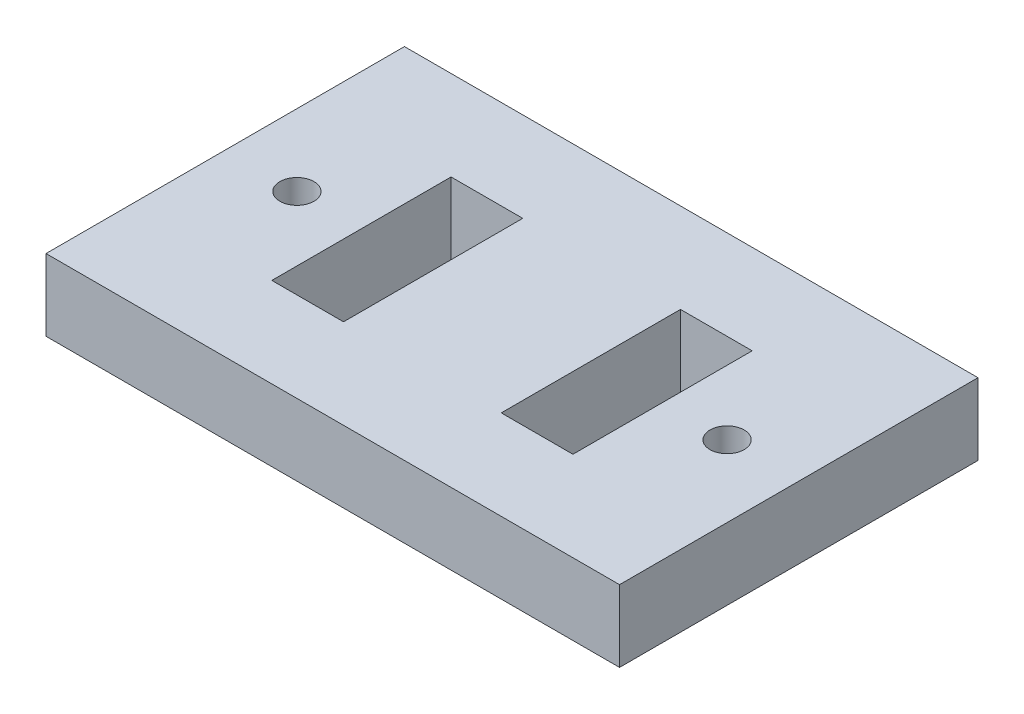
ISO-10303-21;
HEADER;
FILE_DESCRIPTION(('STEP AP214'),'2;1');
FILE_NAME('part.step','',(''),(''),'','','');
FILE_SCHEMA(('AUTOMOTIVE_DESIGN { 1 0 10303 214 1 1 1 1 }'));
ENDSEC;
DATA;
#1=APPLICATION_CONTEXT('core data for automotive mechanical design processes');
#2=APPLICATION_PROTOCOL_DEFINITION('international standard','automotive_design',2000,#1);
#3=PRODUCT_CONTEXT('',#1,'mechanical');
#4=PRODUCT('Part','Part','',(#3));
#5=PRODUCT_RELATED_PRODUCT_CATEGORY('part','',(#4));
#6=PRODUCT_DEFINITION_FORMATION('','',#4);
#7=PRODUCT_DEFINITION_CONTEXT('part definition',#1,'design');
#8=PRODUCT_DEFINITION('design','',#6,#7);
#9=PRODUCT_DEFINITION_SHAPE('','',#8);
#10=(LENGTH_UNIT() NAMED_UNIT(*) SI_UNIT(.MILLI.,.METRE.));
#11=(NAMED_UNIT(*) PLANE_ANGLE_UNIT() SI_UNIT($,.RADIAN.));
#12=(NAMED_UNIT(*) SI_UNIT($,.STERADIAN.) SOLID_ANGLE_UNIT());
#13=UNCERTAINTY_MEASURE_WITH_UNIT(LENGTH_MEASURE(1.E-05),#10,'distance_accuracy_value','');
#14=(GEOMETRIC_REPRESENTATION_CONTEXT(3) GLOBAL_UNCERTAINTY_ASSIGNED_CONTEXT((#13)) GLOBAL_UNIT_ASSIGNED_CONTEXT((#10,
#11,#12)) REPRESENTATION_CONTEXT('',''));
#15=CARTESIAN_POINT('',(0.,0.,0.));
#16=DIRECTION('',(0.,0.,1.));
#17=DIRECTION('',(1.,0.,0.));
#18=AXIS2_PLACEMENT_3D('',#15,#16,#17);
#19=CARTESIAN_POINT('',(40.,10.,25.));
#20=DIRECTION('',(-1.,0.,0.));
#21=DIRECTION('',(0.,0.,1.));
#22=AXIS2_PLACEMENT_3D('',#19,#20,#21);
#23=PLANE('',#22);
#24=DIRECTION('',(0.,0.,-1.));
#25=VECTOR('',#24,1.);
#26=CARTESIAN_POINT('',(40.,0.,25.));
#27=LINE('',#26,#25);
#28=CARTESIAN_POINT('',(40.,0.,25.));
#29=VERTEX_POINT('',#28);
#30=CARTESIAN_POINT('',(40.,0.,-25.));
#31=VERTEX_POINT('',#30);
#32=EDGE_CURVE('E198',#29,#31,#27,.T.);
#33=ORIENTED_EDGE('',*,*,#32,.T.);
#34=DIRECTION('',(0.,-1.,0.));
#35=VECTOR('',#34,1.);
#36=CARTESIAN_POINT('',(40.,10.,-25.));
#37=LINE('',#36,#35);
#38=CARTESIAN_POINT('',(40.,10.,-25.));
#39=VERTEX_POINT('',#38);
#40=EDGE_CURVE('E11',#39,#31,#37,.T.);
#41=ORIENTED_EDGE('',*,*,#40,.F.);
#42=DIRECTION('',(0.,0.,-1.));
#43=VECTOR('',#42,1.);
#44=CARTESIAN_POINT('',(40.,10.,25.));
#45=LINE('',#44,#43);
#46=CARTESIAN_POINT('',(40.,10.,25.));
#47=VERTEX_POINT('',#46);
#48=EDGE_CURVE('E201',#47,#39,#45,.T.);
#49=ORIENTED_EDGE('',*,*,#48,.F.);
#50=DIRECTION('',(0.,-1.,0.));
#51=VECTOR('',#50,1.);
#52=CARTESIAN_POINT('',(40.,10.,25.));
#53=LINE('',#52,#51);
#54=EDGE_CURVE('E211',#47,#29,#53,.T.);
#55=ORIENTED_EDGE('',*,*,#54,.T.);
#56=EDGE_LOOP('',(#33,#41,#49,#55));
#57=FACE_BOUND('',#56,.T.);
#58=ADVANCED_FACE('F32',(#57),#23,.F.);
#59=CARTESIAN_POINT('',(-40.,10.,-25.));
#60=DIRECTION('',(0.,0.,1.));
#61=DIRECTION('',(1.,0.,0.));
#62=AXIS2_PLACEMENT_3D('',#59,#60,#61);
#63=PLANE('',#62);
#64=DIRECTION('',(-1.,0.,0.));
#65=VECTOR('',#64,1.);
#66=CARTESIAN_POINT('',(-40.,0.,-25.));
#67=LINE('',#66,#65);
#68=CARTESIAN_POINT('',(-40.,0.,-25.));
#69=VERTEX_POINT('',#68);
#70=EDGE_CURVE('E214',#31,#69,#67,.T.);
#71=ORIENTED_EDGE('',*,*,#70,.T.);
#72=DIRECTION('',(0.,-1.,0.));
#73=VECTOR('',#72,1.);
#74=CARTESIAN_POINT('',(-40.,10.,-25.));
#75=LINE('',#74,#73);
#76=CARTESIAN_POINT('',(-40.,10.,-25.));
#77=VERTEX_POINT('',#76);
#78=EDGE_CURVE('E39',#77,#69,#75,.T.);
#79=ORIENTED_EDGE('',*,*,#78,.F.);
#80=DIRECTION('',(-1.,0.,0.));
#81=VECTOR('',#80,1.);
#82=CARTESIAN_POINT('',(-40.,10.,-25.));
#83=LINE('',#82,#81);
#84=EDGE_CURVE('E204',#39,#77,#83,.T.);
#85=ORIENTED_EDGE('',*,*,#84,.F.);
#86=ORIENTED_EDGE('',*,*,#40,.T.);
#87=EDGE_LOOP('',(#71,#79,#85,#86));
#88=FACE_BOUND('',#87,.T.);
#89=ADVANCED_FACE('F243',(#88),#63,.F.);
#90=CARTESIAN_POINT('',(-40.,10.,25.));
#91=DIRECTION('',(1.,0.,0.));
#92=DIRECTION('',(0.,0.,-1.));
#93=AXIS2_PLACEMENT_3D('',#90,#91,#92);
#94=PLANE('',#93);
#95=DIRECTION('',(0.,0.,1.));
#96=VECTOR('',#95,1.);
#97=CARTESIAN_POINT('',(-40.,0.,25.));
#98=LINE('',#97,#96);
#99=CARTESIAN_POINT('',(-40.,0.,25.));
#100=VERTEX_POINT('',#99);
#101=EDGE_CURVE('E216',#69,#100,#98,.T.);
#102=ORIENTED_EDGE('',*,*,#101,.T.);
#103=DIRECTION('',(0.,-1.,0.));
#104=VECTOR('',#103,1.);
#105=CARTESIAN_POINT('',(-40.,10.,25.));
#106=LINE('',#105,#104);
#107=CARTESIAN_POINT('',(-40.,10.,25.));
#108=VERTEX_POINT('',#107);
#109=EDGE_CURVE('E221',#108,#100,#106,.T.);
#110=ORIENTED_EDGE('',*,*,#109,.F.);
#111=DIRECTION('',(0.,0.,1.));
#112=VECTOR('',#111,1.);
#113=CARTESIAN_POINT('',(-40.,10.,25.));
#114=LINE('',#113,#112);
#115=EDGE_CURVE('E207',#77,#108,#114,.T.);
#116=ORIENTED_EDGE('',*,*,#115,.F.);
#117=ORIENTED_EDGE('',*,*,#78,.T.);
#118=EDGE_LOOP('',(#102,#110,#116,#117));
#119=FACE_BOUND('',#118,.T.);
#120=ADVANCED_FACE('F228',(#119),#94,.F.);
#121=CARTESIAN_POINT('',(-40.,10.,25.));
#122=DIRECTION('',(0.,0.,-1.));
#123=DIRECTION('',(-1.,0.,0.));
#124=AXIS2_PLACEMENT_3D('',#121,#122,#123);
#125=PLANE('',#124);
#126=DIRECTION('',(1.,0.,0.));
#127=VECTOR('',#126,1.);
#128=CARTESIAN_POINT('',(-40.,0.,25.));
#129=LINE('',#128,#127);
#130=EDGE_CURVE('E205',#100,#29,#129,.T.);
#131=ORIENTED_EDGE('',*,*,#130,.T.);
#132=ORIENTED_EDGE('',*,*,#54,.F.);
#133=DIRECTION('',(1.,0.,0.));
#134=VECTOR('',#133,1.);
#135=CARTESIAN_POINT('',(-40.,10.,25.));
#136=LINE('',#135,#134);
#137=EDGE_CURVE('E209',#108,#47,#136,.T.);
#138=ORIENTED_EDGE('',*,*,#137,.F.);
#139=ORIENTED_EDGE('',*,*,#109,.T.);
#140=EDGE_LOOP('',(#131,#132,#138,#139));
#141=FACE_BOUND('',#140,.T.);
#142=ADVANCED_FACE('F236',(#141),#125,.F.);
#143=CARTESIAN_POINT('',(0.,10.,0.));
#144=DIRECTION('',(0.,-1.,0.));
#145=DIRECTION('',(0.,0.,-1.));
#146=AXIS2_PLACEMENT_3D('',#143,#144,#145);
#147=PLANE('',#146);
#148=DIRECTION('',(-1.,0.,0.));
#149=VECTOR('',#148,1.);
#150=CARTESIAN_POINT('',(11.,10.,-12.5));
#151=LINE('',#150,#149);
#152=CARTESIAN_POINT('',(21.,10.,-12.5));
#153=VERTEX_POINT('',#152);
#154=CARTESIAN_POINT('',(11.,10.,-12.5));
#155=VERTEX_POINT('',#154);
#156=EDGE_CURVE('E147',#153,#155,#151,.T.);
#157=ORIENTED_EDGE('',*,*,#156,.F.);
#158=DIRECTION('',(0.,0.,-1.));
#159=VECTOR('',#158,1.);
#160=CARTESIAN_POINT('',(21.,10.,12.5));
#161=LINE('',#160,#159);
#162=CARTESIAN_POINT('',(21.,10.,12.5));
#163=VERTEX_POINT('',#162);
#164=EDGE_CURVE('E46',#163,#153,#161,.T.);
#165=ORIENTED_EDGE('',*,*,#164,.F.);
#166=DIRECTION('',(1.,0.,0.));
#167=VECTOR('',#166,1.);
#168=CARTESIAN_POINT('',(11.,10.,12.5));
#169=LINE('',#168,#167);
#170=CARTESIAN_POINT('',(11.,10.,12.5));
#171=VERTEX_POINT('',#170);
#172=EDGE_CURVE('E138',#171,#163,#169,.T.);
#173=ORIENTED_EDGE('',*,*,#172,.F.);
#174=DIRECTION('',(0.,0.,1.));
#175=VECTOR('',#174,1.);
#176=CARTESIAN_POINT('',(11.,10.,12.5));
#177=LINE('',#176,#175);
#178=EDGE_CURVE('E141',#155,#171,#177,.T.);
#179=ORIENTED_EDGE('',*,*,#178,.F.);
#180=EDGE_LOOP('',(#157,#165,#173,#179));
#181=FACE_BOUND('',#180,.T.);
#182=DIRECTION('',(-1.,0.,0.));
#183=VECTOR('',#182,1.);
#184=CARTESIAN_POINT('',(-21.,10.,-12.5));
#185=LINE('',#184,#183);
#186=CARTESIAN_POINT('',(-11.,10.,-12.5));
#187=VERTEX_POINT('',#186);
#188=CARTESIAN_POINT('',(-21.,10.,-12.5));
#189=VERTEX_POINT('',#188);
#190=EDGE_CURVE('E172',#187,#189,#185,.T.);
#191=ORIENTED_EDGE('',*,*,#190,.F.);
#192=DIRECTION('',(0.,0.,-1.));
#193=VECTOR('',#192,1.);
#194=CARTESIAN_POINT('',(-11.,10.,12.5));
#195=LINE('',#194,#193);
#196=CARTESIAN_POINT('',(-11.,10.,12.5));
#197=VERTEX_POINT('',#196);
#198=EDGE_CURVE('E153',#197,#187,#195,.T.);
#199=ORIENTED_EDGE('',*,*,#198,.F.);
#200=DIRECTION('',(1.,0.,0.));
#201=VECTOR('',#200,1.);
#202=CARTESIAN_POINT('',(-21.,10.,12.5));
#203=LINE('',#202,#201);
#204=CARTESIAN_POINT('',(-21.,10.,12.5));
#205=VERTEX_POINT('',#204);
#206=EDGE_CURVE('E161',#205,#197,#203,.T.);
#207=ORIENTED_EDGE('',*,*,#206,.F.);
#208=DIRECTION('',(0.,0.,1.));
#209=VECTOR('',#208,1.);
#210=CARTESIAN_POINT('',(-21.,10.,12.5));
#211=LINE('',#210,#209);
#212=EDGE_CURVE('E175',#189,#205,#211,.T.);
#213=ORIENTED_EDGE('',*,*,#212,.F.);
#214=EDGE_LOOP('',(#191,#199,#207,#213));
#215=FACE_BOUND('',#214,.T.);
#216=CARTESIAN_POINT('',(30.,10.,0.));
#217=DIRECTION('',(0.,1.,0.));
#218=DIRECTION('',(0.,0.,1.));
#219=AXIS2_PLACEMENT_3D('',#216,#217,#218);
#220=CIRCLE('',#219,2.38125);
#221=CARTESIAN_POINT('',(30.,10.,2.38125));
#222=VERTEX_POINT('',#221);
#223=EDGE_CURVE('E182',#222,#222,#220,.T.);
#224=ORIENTED_EDGE('',*,*,#223,.F.);
#225=EDGE_LOOP('',(#224));
#226=FACE_BOUND('',#225,.T.);
#227=CARTESIAN_POINT('',(-30.,10.,0.));
#228=DIRECTION('',(0.,1.,0.));
#229=DIRECTION('',(0.,0.,1.));
#230=AXIS2_PLACEMENT_3D('',#227,#228,#229);
#231=CIRCLE('',#230,2.38125);
#232=CARTESIAN_POINT('',(-30.,10.,2.38125));
#233=VERTEX_POINT('',#232);
#234=EDGE_CURVE('E192',#233,#233,#231,.T.);
#235=ORIENTED_EDGE('',*,*,#234,.F.);
#236=EDGE_LOOP('',(#235));
#237=FACE_BOUND('',#236,.T.);
#238=ORIENTED_EDGE('',*,*,#48,.T.);
#239=ORIENTED_EDGE('',*,*,#84,.T.);
#240=ORIENTED_EDGE('',*,*,#115,.T.);
#241=ORIENTED_EDGE('',*,*,#137,.T.);
#242=EDGE_LOOP('',(#238,#239,#240,#241));
#243=FACE_BOUND('',#242,.T.);
#244=ADVANCED_FACE('F242',(#181,#215,#226,#237,#243),#147,.F.);
#245=CARTESIAN_POINT('',(0.,0.,0.));
#246=DIRECTION('',(0.,-1.,0.));
#247=DIRECTION('',(0.,0.,-1.));
#248=AXIS2_PLACEMENT_3D('',#245,#246,#247);
#249=PLANE('',#248);
#250=DIRECTION('',(0.,0.,-1.));
#251=VECTOR('',#250,1.);
#252=CARTESIAN_POINT('',(21.,0.,12.5));
#253=LINE('',#252,#251);
#254=CARTESIAN_POINT('',(21.,0.,12.5));
#255=VERTEX_POINT('',#254);
#256=CARTESIAN_POINT('',(21.,0.,-12.5));
#257=VERTEX_POINT('',#256);
#258=EDGE_CURVE('E122',#255,#257,#253,.T.);
#259=ORIENTED_EDGE('',*,*,#258,.T.);
#260=DIRECTION('',(-1.,0.,0.));
#261=VECTOR('',#260,1.);
#262=CARTESIAN_POINT('',(11.,0.,-12.5));
#263=LINE('',#262,#261);
#264=CARTESIAN_POINT('',(11.,0.,-12.5));
#265=VERTEX_POINT('',#264);
#266=EDGE_CURVE('E131',#257,#265,#263,.T.);
#267=ORIENTED_EDGE('',*,*,#266,.T.);
#268=DIRECTION('',(0.,0.,1.));
#269=VECTOR('',#268,1.);
#270=CARTESIAN_POINT('',(11.,0.,12.5));
#271=LINE('',#270,#269);
#272=CARTESIAN_POINT('',(11.,0.,12.5));
#273=VERTEX_POINT('',#272);
#274=EDGE_CURVE('E54',#265,#273,#271,.T.);
#275=ORIENTED_EDGE('',*,*,#274,.T.);
#276=DIRECTION('',(1.,0.,0.));
#277=VECTOR('',#276,1.);
#278=CARTESIAN_POINT('',(11.,0.,12.5));
#279=LINE('',#278,#277);
#280=EDGE_CURVE('E128',#273,#255,#279,.T.);
#281=ORIENTED_EDGE('',*,*,#280,.T.);
#282=EDGE_LOOP('',(#259,#267,#275,#281));
#283=FACE_BOUND('',#282,.T.);
#284=DIRECTION('',(0.,0.,-1.));
#285=VECTOR('',#284,1.);
#286=CARTESIAN_POINT('',(-11.,0.,12.5));
#287=LINE('',#286,#285);
#288=CARTESIAN_POINT('',(-11.,0.,12.5));
#289=VERTEX_POINT('',#288);
#290=CARTESIAN_POINT('',(-11.,0.,-12.5));
#291=VERTEX_POINT('',#290);
#292=EDGE_CURVE('E157',#289,#291,#287,.T.);
#293=ORIENTED_EDGE('',*,*,#292,.T.);
#294=DIRECTION('',(-1.,0.,0.));
#295=VECTOR('',#294,1.);
#296=CARTESIAN_POINT('',(-21.,0.,-12.5));
#297=LINE('',#296,#295);
#298=CARTESIAN_POINT('',(-21.,0.,-12.5));
#299=VERTEX_POINT('',#298);
#300=EDGE_CURVE('E160',#291,#299,#297,.T.);
#301=ORIENTED_EDGE('',*,*,#300,.T.);
#302=DIRECTION('',(0.,0.,1.));
#303=VECTOR('',#302,1.);
#304=CARTESIAN_POINT('',(-21.,0.,12.5));
#305=LINE('',#304,#303);
#306=CARTESIAN_POINT('',(-21.,0.,12.5));
#307=VERTEX_POINT('',#306);
#308=EDGE_CURVE('E164',#299,#307,#305,.T.);
#309=ORIENTED_EDGE('',*,*,#308,.T.);
#310=DIRECTION('',(1.,0.,0.));
#311=VECTOR('',#310,1.);
#312=CARTESIAN_POINT('',(-21.,0.,12.5));
#313=LINE('',#312,#311);
#314=EDGE_CURVE('E167',#307,#289,#313,.T.);
#315=ORIENTED_EDGE('',*,*,#314,.T.);
#316=EDGE_LOOP('',(#293,#301,#309,#315));
#317=FACE_BOUND('',#316,.T.);
#318=CARTESIAN_POINT('',(30.,0.,0.));
#319=DIRECTION('',(0.,1.,0.));
#320=DIRECTION('',(0.,0.,1.));
#321=AXIS2_PLACEMENT_3D('',#318,#319,#320);
#322=CIRCLE('',#321,2.38125);
#323=CARTESIAN_POINT('',(30.,0.,2.38125));
#324=VERTEX_POINT('',#323);
#325=EDGE_CURVE('E189',#324,#324,#322,.T.);
#326=ORIENTED_EDGE('',*,*,#325,.T.);
#327=EDGE_LOOP('',(#326));
#328=FACE_BOUND('',#327,.T.);
#329=CARTESIAN_POINT('',(-30.,0.,0.));
#330=DIRECTION('',(0.,1.,0.));
#331=DIRECTION('',(0.,0.,1.));
#332=AXIS2_PLACEMENT_3D('',#329,#330,#331);
#333=CIRCLE('',#332,2.38125);
#334=CARTESIAN_POINT('',(-30.,0.,2.38125));
#335=VERTEX_POINT('',#334);
#336=EDGE_CURVE('E195',#335,#335,#333,.T.);
#337=ORIENTED_EDGE('',*,*,#336,.T.);
#338=EDGE_LOOP('',(#337));
#339=FACE_BOUND('',#338,.T.);
#340=ORIENTED_EDGE('',*,*,#32,.F.);
#341=ORIENTED_EDGE('',*,*,#130,.F.);
#342=ORIENTED_EDGE('',*,*,#101,.F.);
#343=ORIENTED_EDGE('',*,*,#70,.F.);
#344=EDGE_LOOP('',(#340,#341,#342,#343));
#345=FACE_BOUND('',#344,.T.);
#346=ADVANCED_FACE('F135',(#283,#317,#328,#339,#345),#249,.T.);
#347=CARTESIAN_POINT('',(-30.,0.,0.));
#348=DIRECTION('',(0.,1.,0.));
#349=DIRECTION('',(0.,0.,1.));
#350=AXIS2_PLACEMENT_3D('',#347,#348,#349);
#351=CYLINDRICAL_SURFACE('',#350,2.38125);
#352=ORIENTED_EDGE('',*,*,#336,.F.);
#353=EDGE_LOOP('',(#352));
#354=FACE_BOUND('',#353,.T.);
#355=ORIENTED_EDGE('',*,*,#234,.T.);
#356=EDGE_LOOP('',(#355));
#357=FACE_BOUND('',#356,.T.);
#358=ADVANCED_FACE('F255',(#354,#357),#351,.F.);
#359=CARTESIAN_POINT('',(30.,0.,0.));
#360=DIRECTION('',(0.,1.,0.));
#361=DIRECTION('',(0.,0.,1.));
#362=AXIS2_PLACEMENT_3D('',#359,#360,#361);
#363=CYLINDRICAL_SURFACE('',#362,2.38125);
#364=ORIENTED_EDGE('',*,*,#325,.F.);
#365=EDGE_LOOP('',(#364));
#366=FACE_BOUND('',#365,.T.);
#367=ORIENTED_EDGE('',*,*,#223,.T.);
#368=EDGE_LOOP('',(#367));
#369=FACE_BOUND('',#368,.T.);
#370=ADVANCED_FACE('F261',(#366,#369),#363,.F.);
#371=CARTESIAN_POINT('',(-11.,0.,12.5));
#372=DIRECTION('',(1.,0.,0.));
#373=DIRECTION('',(0.,0.,-1.));
#374=AXIS2_PLACEMENT_3D('',#371,#372,#373);
#375=PLANE('',#374);
#376=ORIENTED_EDGE('',*,*,#198,.T.);
#377=DIRECTION('',(0.,1.,0.));
#378=VECTOR('',#377,1.);
#379=CARTESIAN_POINT('',(-11.,0.,-12.5));
#380=LINE('',#379,#378);
#381=EDGE_CURVE('E170',#291,#187,#380,.T.);
#382=ORIENTED_EDGE('',*,*,#381,.F.);
#383=ORIENTED_EDGE('',*,*,#292,.F.);
#384=DIRECTION('',(0.,1.,0.));
#385=VECTOR('',#384,1.);
#386=CARTESIAN_POINT('',(-11.,0.,12.5));
#387=LINE('',#386,#385);
#388=EDGE_CURVE('E180',#289,#197,#387,.T.);
#389=ORIENTED_EDGE('',*,*,#388,.T.);
#390=EDGE_LOOP('',(#376,#382,#383,#389));
#391=FACE_BOUND('',#390,.T.);
#392=ADVANCED_FACE('F265',(#391),#375,.F.);
#393=CARTESIAN_POINT('',(-21.,0.,12.5));
#394=DIRECTION('',(0.,0.,1.));
#395=DIRECTION('',(1.,0.,0.));
#396=AXIS2_PLACEMENT_3D('',#393,#394,#395);
#397=PLANE('',#396);
#398=ORIENTED_EDGE('',*,*,#206,.T.);
#399=ORIENTED_EDGE('',*,*,#388,.F.);
#400=ORIENTED_EDGE('',*,*,#314,.F.);
#401=DIRECTION('',(0.,1.,0.));
#402=VECTOR('',#401,1.);
#403=CARTESIAN_POINT('',(-21.,0.,12.5));
#404=LINE('',#403,#402);
#405=EDGE_CURVE('E183',#307,#205,#404,.T.);
#406=ORIENTED_EDGE('',*,*,#405,.T.);
#407=EDGE_LOOP('',(#398,#399,#400,#406));
#408=FACE_BOUND('',#407,.T.);
#409=ADVANCED_FACE('F269',(#408),#397,.F.);
#410=CARTESIAN_POINT('',(-21.,0.,12.5));
#411=DIRECTION('',(-1.,0.,0.));
#412=DIRECTION('',(0.,0.,1.));
#413=AXIS2_PLACEMENT_3D('',#410,#411,#412);
#414=PLANE('',#413);
#415=ORIENTED_EDGE('',*,*,#212,.T.);
#416=ORIENTED_EDGE('',*,*,#405,.F.);
#417=ORIENTED_EDGE('',*,*,#308,.F.);
#418=DIRECTION('',(0.,1.,0.));
#419=VECTOR('',#418,1.);
#420=CARTESIAN_POINT('',(-21.,0.,-12.5));
#421=LINE('',#420,#419);
#422=EDGE_CURVE('E185',#299,#189,#421,.T.);
#423=ORIENTED_EDGE('',*,*,#422,.T.);
#424=EDGE_LOOP('',(#415,#416,#417,#423));
#425=FACE_BOUND('',#424,.T.);
#426=ADVANCED_FACE('F274',(#425),#414,.F.);
#427=CARTESIAN_POINT('',(-21.,0.,-12.5));
#428=DIRECTION('',(0.,0.,-1.));
#429=DIRECTION('',(-1.,0.,0.));
#430=AXIS2_PLACEMENT_3D('',#427,#428,#429);
#431=PLANE('',#430);
#432=ORIENTED_EDGE('',*,*,#190,.T.);
#433=ORIENTED_EDGE('',*,*,#422,.F.);
#434=ORIENTED_EDGE('',*,*,#300,.F.);
#435=ORIENTED_EDGE('',*,*,#381,.T.);
#436=EDGE_LOOP('',(#432,#433,#434,#435));
#437=FACE_BOUND('',#436,.T.);
#438=ADVANCED_FACE('F271',(#437),#431,.F.);
#439=CARTESIAN_POINT('',(21.,0.,12.5));
#440=DIRECTION('',(1.,0.,0.));
#441=DIRECTION('',(0.,0.,-1.));
#442=AXIS2_PLACEMENT_3D('',#439,#440,#441);
#443=PLANE('',#442);
#444=ORIENTED_EDGE('',*,*,#164,.T.);
#445=DIRECTION('',(0.,1.,0.));
#446=VECTOR('',#445,1.);
#447=CARTESIAN_POINT('',(21.,0.,-12.5));
#448=LINE('',#447,#446);
#449=EDGE_CURVE('E118',#257,#153,#448,.T.);
#450=ORIENTED_EDGE('',*,*,#449,.F.);
#451=ORIENTED_EDGE('',*,*,#258,.F.);
#452=DIRECTION('',(0.,1.,0.));
#453=VECTOR('',#452,1.);
#454=CARTESIAN_POINT('',(21.,0.,12.5));
#455=LINE('',#454,#453);
#456=EDGE_CURVE('E151',#255,#163,#455,.T.);
#457=ORIENTED_EDGE('',*,*,#456,.T.);
#458=EDGE_LOOP('',(#444,#450,#451,#457));
#459=FACE_BOUND('',#458,.T.);
#460=ADVANCED_FACE('F120',(#459),#443,.F.);
#461=CARTESIAN_POINT('',(11.,0.,12.5));
#462=DIRECTION('',(0.,0.,1.));
#463=DIRECTION('',(1.,0.,0.));
#464=AXIS2_PLACEMENT_3D('',#461,#462,#463);
#465=PLANE('',#464);
#466=ORIENTED_EDGE('',*,*,#172,.T.);
#467=ORIENTED_EDGE('',*,*,#456,.F.);
#468=ORIENTED_EDGE('',*,*,#280,.F.);
#469=DIRECTION('',(0.,1.,0.));
#470=VECTOR('',#469,1.);
#471=CARTESIAN_POINT('',(11.,0.,12.5));
#472=LINE('',#471,#470);
#473=EDGE_CURVE('E154',#273,#171,#472,.T.);
#474=ORIENTED_EDGE('',*,*,#473,.T.);
#475=EDGE_LOOP('',(#466,#467,#468,#474));
#476=FACE_BOUND('',#475,.T.);
#477=ADVANCED_FACE('F284',(#476),#465,.F.);
#478=CARTESIAN_POINT('',(11.,0.,12.5));
#479=DIRECTION('',(-1.,0.,0.));
#480=DIRECTION('',(0.,0.,1.));
#481=AXIS2_PLACEMENT_3D('',#478,#479,#480);
#482=PLANE('',#481);
#483=ORIENTED_EDGE('',*,*,#178,.T.);
#484=ORIENTED_EDGE('',*,*,#473,.F.);
#485=ORIENTED_EDGE('',*,*,#274,.F.);
#486=DIRECTION('',(0.,1.,0.));
#487=VECTOR('',#486,1.);
#488=CARTESIAN_POINT('',(11.,0.,-12.5));
#489=LINE('',#488,#487);
#490=EDGE_CURVE('E127',#265,#155,#489,.T.);
#491=ORIENTED_EDGE('',*,*,#490,.T.);
#492=EDGE_LOOP('',(#483,#484,#485,#491));
#493=FACE_BOUND('',#492,.T.);
#494=ADVANCED_FACE('F287',(#493),#482,.F.);
#495=CARTESIAN_POINT('',(11.,0.,-12.5));
#496=DIRECTION('',(0.,0.,-1.));
#497=DIRECTION('',(-1.,0.,0.));
#498=AXIS2_PLACEMENT_3D('',#495,#496,#497);
#499=PLANE('',#498);
#500=ORIENTED_EDGE('',*,*,#156,.T.);
#501=ORIENTED_EDGE('',*,*,#490,.F.);
#502=ORIENTED_EDGE('',*,*,#266,.F.);
#503=ORIENTED_EDGE('',*,*,#449,.T.);
#504=EDGE_LOOP('',(#500,#501,#502,#503));
#505=FACE_BOUND('',#504,.T.);
#506=ADVANCED_FACE('F132',(#505),#499,.F.);
#507=CLOSED_SHELL('',(#58,#89,#120,#142,#244,#346,#358,#370,#392,#409,#426,#438,#460,#477,#494,#506));
#508=MANIFOLD_SOLID_BREP('B2',#507);
#509=ADVANCED_BREP_SHAPE_REPRESENTATION('',(#18,#508),#14);
#510=SHAPE_DEFINITION_REPRESENTATION(#9,#509);
ENDSEC;
END-ISO-10303-21;
